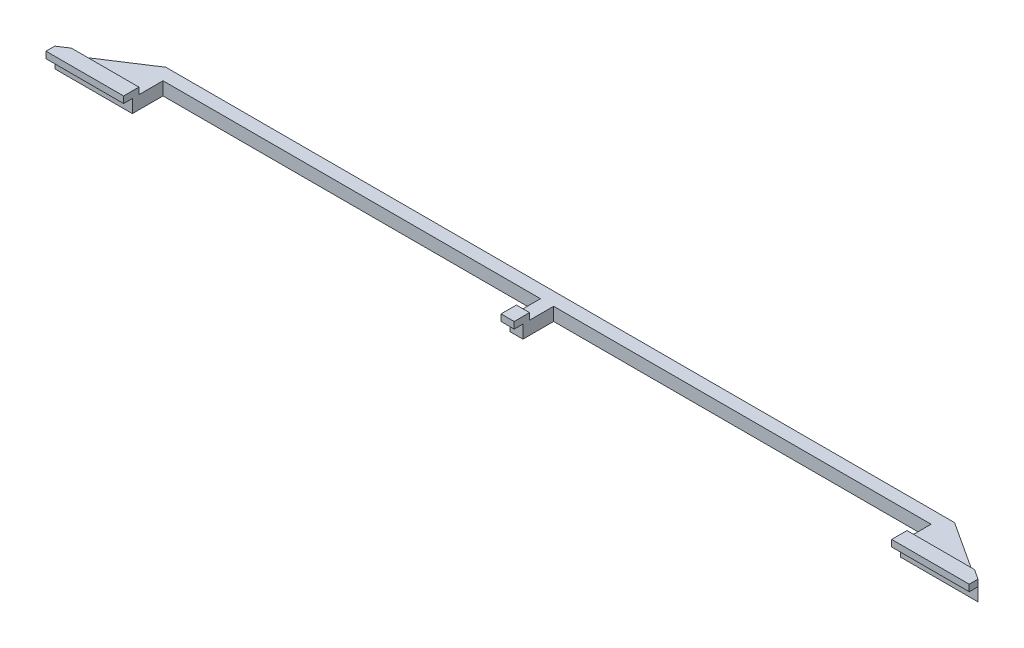
ISO-10303-21;
HEADER;
FILE_DESCRIPTION(('STEP AP214'),'2;1');
FILE_NAME('part.step','',(''),(''),'','','');
FILE_SCHEMA(('AUTOMOTIVE_DESIGN { 1 0 10303 214 1 1 1 1 }'));
ENDSEC;
DATA;
#1=APPLICATION_CONTEXT('core data for automotive mechanical design processes');
#2=APPLICATION_PROTOCOL_DEFINITION('international standard','automotive_design',2000,#1);
#3=PRODUCT_CONTEXT('',#1,'mechanical');
#4=PRODUCT('Part','Part','',(#3));
#5=PRODUCT_RELATED_PRODUCT_CATEGORY('part','',(#4));
#6=PRODUCT_DEFINITION_FORMATION('','',#4);
#7=PRODUCT_DEFINITION_CONTEXT('part definition',#1,'design');
#8=PRODUCT_DEFINITION('design','',#6,#7);
#9=PRODUCT_DEFINITION_SHAPE('','',#8);
#10=(LENGTH_UNIT() NAMED_UNIT(*) SI_UNIT(.MILLI.,.METRE.));
#11=(NAMED_UNIT(*) PLANE_ANGLE_UNIT() SI_UNIT($,.RADIAN.));
#12=(NAMED_UNIT(*) SI_UNIT($,.STERADIAN.) SOLID_ANGLE_UNIT());
#13=UNCERTAINTY_MEASURE_WITH_UNIT(LENGTH_MEASURE(1.E-05),#10,'distance_accuracy_value','');
#14=(GEOMETRIC_REPRESENTATION_CONTEXT(3) GLOBAL_UNCERTAINTY_ASSIGNED_CONTEXT((#13)) GLOBAL_UNIT_ASSIGNED_CONTEXT((#10,
#11,#12)) REPRESENTATION_CONTEXT('',''));
#15=CARTESIAN_POINT('',(0.,0.,0.));
#16=DIRECTION('',(0.,0.,1.));
#17=DIRECTION('',(1.,0.,0.));
#18=AXIS2_PLACEMENT_3D('',#15,#16,#17);
#19=CARTESIAN_POINT('',(450.,0.,85.));
#20=DIRECTION('',(0.,0.,1.));
#21=DIRECTION('',(1.,0.,0.));
#22=AXIS2_PLACEMENT_3D('',#19,#20,#21);
#23=PLANE('',#22);
#24=DIRECTION('',(1.,0.,0.));
#25=VECTOR('',#24,1.);
#26=CARTESIAN_POINT('',(450.,0.,85.));
#27=LINE('',#26,#25);
#28=CARTESIAN_POINT('',(435.,0.,85.));
#29=VERTEX_POINT('',#28);
#30=CARTESIAN_POINT('',(465.,0.,85.));
#31=VERTEX_POINT('',#30);
#32=EDGE_CURVE('E231',#29,#31,#27,.T.);
#33=ORIENTED_EDGE('',*,*,#32,.T.);
#34=DIRECTION('',(0.,1.,0.));
#35=VECTOR('',#34,1.);
#36=CARTESIAN_POINT('',(465.,0.,85.));
#37=LINE('',#36,#35);
#38=CARTESIAN_POINT('',(465.,29.8945097316654,85.));
#39=VERTEX_POINT('',#38);
#40=EDGE_CURVE('E213',#31,#39,#37,.T.);
#41=ORIENTED_EDGE('',*,*,#40,.T.);
#42=DIRECTION('',(-0.999975271591242,0.00703251064853963,0.));
#43=VECTOR('',#42,1.);
#44=CARTESIAN_POINT('',(450.,30.,85.));
#45=LINE('',#44,#43);
#46=CARTESIAN_POINT('',(450.,30.,85.));
#47=VERTEX_POINT('',#46);
#48=EDGE_CURVE('E221',#39,#47,#45,.T.);
#49=ORIENTED_EDGE('',*,*,#48,.T.);
#50=DIRECTION('',(0.999975271591242,0.00703251064853963,0.));
#51=VECTOR('',#50,1.);
#52=CARTESIAN_POINT('',(450.,30.,85.));
#53=LINE('',#52,#51);
#54=CARTESIAN_POINT('',(435.,29.8945097316654,85.));
#55=VERTEX_POINT('',#54);
#56=EDGE_CURVE('E280',#55,#47,#53,.T.);
#57=ORIENTED_EDGE('',*,*,#56,.F.);
#58=DIRECTION('',(0.,1.,0.));
#59=VECTOR('',#58,1.);
#60=CARTESIAN_POINT('',(435.,0.,85.));
#61=LINE('',#60,#59);
#62=EDGE_CURVE('E335',#29,#55,#61,.T.);
#63=ORIENTED_EDGE('',*,*,#62,.F.);
#64=EDGE_LOOP('',(#33,#41,#49,#57,#63));
#65=FACE_BOUND('',#64,.T.);
#66=ADVANCED_FACE('F36',(#65),#23,.T.);
#67=CARTESIAN_POINT('',(-603.496801426117,0.,84.9999999999999));
#68=DIRECTION('',(0.,0.,1.));
#69=DIRECTION('',(1.,0.,0.));
#70=AXIS2_PLACEMENT_3D('',#67,#68,#69);
#71=PLANE('',#70);
#72=DIRECTION('',(0.,1.,0.));
#73=VECTOR('',#72,1.);
#74=CARTESIAN_POINT('',(-426.449083655733,0.,85.));
#75=LINE('',#74,#73);
#76=CARTESIAN_POINT('',(-426.449083655733,0.,85.));
#77=VERTEX_POINT('',#76);
#78=CARTESIAN_POINT('',(-426.449083655733,30.,85.));
#79=VERTEX_POINT('',#78);
#80=EDGE_CURVE('E356',#77,#79,#75,.T.);
#81=ORIENTED_EDGE('',*,*,#80,.T.);
#82=DIRECTION('',(1.,0.,0.));
#83=VECTOR('',#82,1.);
#84=CARTESIAN_POINT('',(-426.449083655733,30.,85.));
#85=LINE('',#84,#83);
#86=CARTESIAN_POINT('',(-603.496801426117,30.,85.));
#87=VERTEX_POINT('',#86);
#88=EDGE_CURVE('E295',#87,#79,#85,.T.);
#89=ORIENTED_EDGE('',*,*,#88,.F.);
#90=DIRECTION('',(0.,1.,0.));
#91=VECTOR('',#90,1.);
#92=CARTESIAN_POINT('',(-603.496801426117,0.,84.9999999999999));
#93=LINE('',#92,#91);
#94=CARTESIAN_POINT('',(-603.496801426117,0.,84.9999999999999));
#95=VERTEX_POINT('',#94);
#96=EDGE_CURVE('E359',#95,#87,#93,.T.);
#97=ORIENTED_EDGE('',*,*,#96,.F.);
#98=DIRECTION('',(1.,0.,0.));
#99=VECTOR('',#98,1.);
#100=CARTESIAN_POINT('',(-603.496801426117,0.,84.9999999999999));
#101=LINE('',#100,#99);
#102=EDGE_CURVE('E346',#95,#77,#101,.T.);
#103=ORIENTED_EDGE('',*,*,#102,.T.);
#104=EDGE_LOOP('',(#81,#89,#97,#103));
#105=FACE_BOUND('',#104,.T.);
#106=ADVANCED_FACE('F387',(#105),#71,.T.);
#107=CARTESIAN_POINT('',(0.,30.,0.));
#108=DIRECTION('',(0.,-1.,0.));
#109=DIRECTION('',(0.,0.,-1.));
#110=AXIS2_PLACEMENT_3D('',#107,#108,#109);
#111=PLANE('',#110);
#112=DIRECTION('',(-1.,0.,0.));
#113=VECTOR('',#112,1.);
#114=CARTESIAN_POINT('',(435.,30.,69.9999999999998));
#115=LINE('',#114,#113);
#116=CARTESIAN_POINT('',(465.,30.,69.9999999999998));
#117=VERTEX_POINT('',#116);
#118=CARTESIAN_POINT('',(435.,30.,69.9999999999998));
#119=VERTEX_POINT('',#118);
#120=EDGE_CURVE('E316',#117,#119,#115,.T.);
#121=ORIENTED_EDGE('',*,*,#120,.F.);
#122=DIRECTION('',(0.,0.,1.));
#123=VECTOR('',#122,1.);
#124=CARTESIAN_POINT('',(465.,30.,85.));
#125=LINE('',#124,#123);
#126=CARTESIAN_POINT('',(465.,30.,15.));
#127=VERTEX_POINT('',#126);
#128=EDGE_CURVE('E236',#127,#117,#125,.T.);
#129=ORIENTED_EDGE('',*,*,#128,.F.);
#130=DIRECTION('',(-1.,0.,0.));
#131=VECTOR('',#130,1.);
#132=CARTESIAN_POINT('',(450.,30.,14.9999999999999));
#133=LINE('',#132,#131);
#134=CARTESIAN_POINT('',(1326.44908365573,30.,15.0000000000001));
#135=VERTEX_POINT('',#134);
#136=EDGE_CURVE('E269',#135,#127,#133,.T.);
#137=ORIENTED_EDGE('',*,*,#136,.F.);
#138=DIRECTION('',(0.,0.,-1.));
#139=VECTOR('',#138,1.);
#140=CARTESIAN_POINT('',(1326.44908365573,30.,85.));
#141=LINE('',#140,#139);
#142=CARTESIAN_POINT('',(1326.44908365573,30.,69.9999999999998));
#143=VERTEX_POINT('',#142);
#144=EDGE_CURVE('E246',#143,#135,#141,.T.);
#145=ORIENTED_EDGE('',*,*,#144,.F.);
#146=DIRECTION('',(1.,0.,0.));
#147=VECTOR('',#146,1.);
#148=CARTESIAN_POINT('',(1480.4722812122,30.,69.9999999999998));
#149=LINE('',#148,#147);
#150=CARTESIAN_POINT('',(1480.4722812122,30.,69.9999999999998));
#151=VERTEX_POINT('',#150);
#152=EDGE_CURVE('E428',#143,#151,#149,.T.);
#153=ORIENTED_EDGE('',*,*,#152,.T.);
#154=DIRECTION('',(0.837876769017591,0.,0.545859432400542));
#155=VECTOR('',#154,1.);
#156=CARTESIAN_POINT('',(1350.,30.,-14.9999999999999));
#157=LINE('',#156,#155);
#158=CARTESIAN_POINT('',(1350.,30.,-14.9999999999999));
#159=VERTEX_POINT('',#158);
#160=EDGE_CURVE('E251',#159,#151,#157,.T.);
#161=ORIENTED_EDGE('',*,*,#160,.F.);
#162=DIRECTION('',(-1.,0.,0.));
#163=VECTOR('',#162,1.);
#164=CARTESIAN_POINT('',(450.,30.,-15.0000000000001));
#165=LINE('',#164,#163);
#166=CARTESIAN_POINT('',(-450.,30.,-14.9999999999999));
#167=VERTEX_POINT('',#166);
#168=EDGE_CURVE('E44',#159,#167,#165,.T.);
#169=ORIENTED_EDGE('',*,*,#168,.T.);
#170=DIRECTION('',(-0.837876769017591,0.,0.545859432400542));
#171=VECTOR('',#170,1.);
#172=CARTESIAN_POINT('',(-450.,30.,-14.9999999999999));
#173=LINE('',#172,#171);
#174=CARTESIAN_POINT('',(-580.472281212199,30.,69.9999999999998));
#175=VERTEX_POINT('',#174);
#176=EDGE_CURVE('E350',#167,#175,#173,.T.);
#177=ORIENTED_EDGE('',*,*,#176,.T.);
#178=DIRECTION('',(-1.,0.,0.));
#179=VECTOR('',#178,1.);
#180=CARTESIAN_POINT('',(-580.472281212199,30.,69.9999999999998));
#181=LINE('',#180,#179);
#182=CARTESIAN_POINT('',(-426.449083655733,30.,69.9999999999998));
#183=VERTEX_POINT('',#182);
#184=EDGE_CURVE('E58',#183,#175,#181,.T.);
#185=ORIENTED_EDGE('',*,*,#184,.F.);
#186=DIRECTION('',(0.,0.,-1.));
#187=VECTOR('',#186,1.);
#188=CARTESIAN_POINT('',(-426.449083655733,30.,85.));
#189=LINE('',#188,#187);
#190=CARTESIAN_POINT('',(-426.449083655733,30.,15.0000000000001));
#191=VERTEX_POINT('',#190);
#192=EDGE_CURVE('E345',#183,#191,#189,.T.);
#193=ORIENTED_EDGE('',*,*,#192,.T.);
#194=DIRECTION('',(1.,0.,0.));
#195=VECTOR('',#194,1.);
#196=CARTESIAN_POINT('',(450.,30.,14.9999999999999));
#197=LINE('',#196,#195);
#198=CARTESIAN_POINT('',(435.,30.,15.));
#199=VERTEX_POINT('',#198);
#200=EDGE_CURVE('E367',#191,#199,#197,.T.);
#201=ORIENTED_EDGE('',*,*,#200,.T.);
#202=DIRECTION('',(0.,0.,1.));
#203=VECTOR('',#202,1.);
#204=CARTESIAN_POINT('',(435.,30.,85.));
#205=LINE('',#204,#203);
#206=EDGE_CURVE('E51',#199,#119,#205,.T.);
#207=ORIENTED_EDGE('',*,*,#206,.T.);
#208=EDGE_LOOP('',(#121,#129,#137,#145,#153,#161,#169,#177,#185,#193,#201,#207));
#209=FACE_BOUND('',#208,.T.);
#210=ADVANCED_FACE('F408',(#209),#111,.F.);
#211=CARTESIAN_POINT('',(450.,30.,14.9999999999999));
#212=DIRECTION('',(0.,0.,-1.));
#213=DIRECTION('',(-1.,0.,0.));
#214=AXIS2_PLACEMENT_3D('',#211,#212,#213);
#215=PLANE('',#214);
#216=DIRECTION('',(1.,0.,0.));
#217=VECTOR('',#216,1.);
#218=CARTESIAN_POINT('',(450.,0.,14.9999999999999));
#219=LINE('',#218,#217);
#220=CARTESIAN_POINT('',(-426.449083655733,0.,15.0000000000001));
#221=VERTEX_POINT('',#220);
#222=CARTESIAN_POINT('',(435.,0.,15.));
#223=VERTEX_POINT('',#222);
#224=EDGE_CURVE('E366',#221,#223,#219,.T.);
#225=ORIENTED_EDGE('',*,*,#224,.T.);
#226=DIRECTION('',(0.,1.,0.));
#227=VECTOR('',#226,1.);
#228=CARTESIAN_POINT('',(435.,30.,14.9999999999999));
#229=LINE('',#228,#227);
#230=EDGE_CURVE('E339',#223,#199,#229,.T.);
#231=ORIENTED_EDGE('',*,*,#230,.T.);
#232=ORIENTED_EDGE('',*,*,#200,.F.);
#233=DIRECTION('',(0.,-1.,0.));
#234=VECTOR('',#233,1.);
#235=CARTESIAN_POINT('',(-426.449083655733,30.,15.0000000000001));
#236=LINE('',#235,#234);
#237=EDGE_CURVE('E362',#191,#221,#236,.T.);
#238=ORIENTED_EDGE('',*,*,#237,.T.);
#239=EDGE_LOOP('',(#225,#231,#232,#238));
#240=FACE_BOUND('',#239,.T.);
#241=ADVANCED_FACE('F38',(#240),#215,.F.);
#242=CARTESIAN_POINT('',(450.,30.,-15.0000000000001));
#243=DIRECTION('',(0.,0.,1.));
#244=DIRECTION('',(1.,0.,0.));
#245=AXIS2_PLACEMENT_3D('',#242,#243,#244);
#246=PLANE('',#245);
#247=DIRECTION('',(0.,-1.,0.));
#248=VECTOR('',#247,1.);
#249=CARTESIAN_POINT('',(-450.,30.,-14.9999999999999));
#250=LINE('',#249,#248);
#251=CARTESIAN_POINT('',(-450.,0.,-14.9999999999999));
#252=VERTEX_POINT('',#251);
#253=EDGE_CURVE('E11',#167,#252,#250,.T.);
#254=ORIENTED_EDGE('',*,*,#253,.F.);
#255=ORIENTED_EDGE('',*,*,#168,.F.);
#256=DIRECTION('',(0.,-1.,0.));
#257=VECTOR('',#256,1.);
#258=CARTESIAN_POINT('',(1350.,30.,-14.9999999999999));
#259=LINE('',#258,#257);
#260=CARTESIAN_POINT('',(1350.,0.,-14.9999999999999));
#261=VERTEX_POINT('',#260);
#262=EDGE_CURVE('E272',#159,#261,#259,.T.);
#263=ORIENTED_EDGE('',*,*,#262,.T.);
#264=DIRECTION('',(-1.,0.,0.));
#265=VECTOR('',#264,1.);
#266=CARTESIAN_POINT('',(450.,0.,-15.0000000000001));
#267=LINE('',#266,#265);
#268=EDGE_CURVE('E369',#261,#252,#267,.T.);
#269=ORIENTED_EDGE('',*,*,#268,.T.);
#270=EDGE_LOOP('',(#254,#255,#263,#269));
#271=FACE_BOUND('',#270,.T.);
#272=ADVANCED_FACE('F374',(#271),#246,.F.);
#273=CARTESIAN_POINT('',(0.,0.,0.));
#274=DIRECTION('',(0.,-1.,0.));
#275=DIRECTION('',(0.,0.,-1.));
#276=AXIS2_PLACEMENT_3D('',#273,#274,#275);
#277=PLANE('',#276);
#278=DIRECTION('',(-0.837876769017591,0.,0.545859432400542));
#279=VECTOR('',#278,1.);
#280=CARTESIAN_POINT('',(-450.,0.,-14.9999999999999));
#281=LINE('',#280,#279);
#282=EDGE_CURVE('E353',#252,#95,#281,.T.);
#283=ORIENTED_EDGE('',*,*,#282,.F.);
#284=ORIENTED_EDGE('',*,*,#268,.F.);
#285=DIRECTION('',(0.837876769017591,0.,0.545859432400542));
#286=VECTOR('',#285,1.);
#287=CARTESIAN_POINT('',(1350.,0.,-14.9999999999999));
#288=LINE('',#287,#286);
#289=CARTESIAN_POINT('',(1503.49680142612,0.,84.9999999999999));
#290=VERTEX_POINT('',#289);
#291=EDGE_CURVE('E253',#261,#290,#288,.T.);
#292=ORIENTED_EDGE('',*,*,#291,.T.);
#293=DIRECTION('',(-1.,0.,0.));
#294=VECTOR('',#293,1.);
#295=CARTESIAN_POINT('',(1503.49680142612,0.,84.9999999999999));
#296=LINE('',#295,#294);
#297=CARTESIAN_POINT('',(1326.44908365573,0.,85.));
#298=VERTEX_POINT('',#297);
#299=EDGE_CURVE('E247',#290,#298,#296,.T.);
#300=ORIENTED_EDGE('',*,*,#299,.T.);
#301=DIRECTION('',(0.,0.,-1.));
#302=VECTOR('',#301,1.);
#303=CARTESIAN_POINT('',(1326.44908365573,0.,85.));
#304=LINE('',#303,#302);
#305=CARTESIAN_POINT('',(1326.44908365573,0.,15.0000000000001));
#306=VERTEX_POINT('',#305);
#307=EDGE_CURVE('E250',#298,#306,#304,.T.);
#308=ORIENTED_EDGE('',*,*,#307,.T.);
#309=DIRECTION('',(-1.,0.,0.));
#310=VECTOR('',#309,1.);
#311=CARTESIAN_POINT('',(450.,0.,14.9999999999999));
#312=LINE('',#311,#310);
#313=CARTESIAN_POINT('',(465.,0.,15.));
#314=VERTEX_POINT('',#313);
#315=EDGE_CURVE('E268',#306,#314,#312,.T.);
#316=ORIENTED_EDGE('',*,*,#315,.T.);
#317=DIRECTION('',(0.,0.,1.));
#318=VECTOR('',#317,1.);
#319=CARTESIAN_POINT('',(465.,0.,85.));
#320=LINE('',#319,#318);
#321=EDGE_CURVE('E233',#314,#31,#320,.T.);
#322=ORIENTED_EDGE('',*,*,#321,.T.);
#323=ORIENTED_EDGE('',*,*,#32,.F.);
#324=DIRECTION('',(0.,0.,1.));
#325=VECTOR('',#324,1.);
#326=CARTESIAN_POINT('',(435.,0.,85.));
#327=LINE('',#326,#325);
#328=EDGE_CURVE('E340',#223,#29,#327,.T.);
#329=ORIENTED_EDGE('',*,*,#328,.F.);
#330=ORIENTED_EDGE('',*,*,#224,.F.);
#331=DIRECTION('',(0.,0.,-1.));
#332=VECTOR('',#331,1.);
#333=CARTESIAN_POINT('',(-426.449083655733,0.,85.));
#334=LINE('',#333,#332);
#335=EDGE_CURVE('E349',#77,#221,#334,.T.);
#336=ORIENTED_EDGE('',*,*,#335,.F.);
#337=ORIENTED_EDGE('',*,*,#102,.F.);
#338=EDGE_LOOP('',(#283,#284,#292,#300,#308,#316,#322,#323,#329,#330,#336,#337));
#339=FACE_BOUND('',#338,.T.);
#340=ADVANCED_FACE('F383',(#339),#277,.T.);
#341=CARTESIAN_POINT('',(-426.449083655733,0.,85.));
#342=DIRECTION('',(1.,0.,0.));
#343=DIRECTION('',(0.,0.,-1.));
#344=AXIS2_PLACEMENT_3D('',#341,#342,#343);
#345=PLANE('',#344);
#346=ORIENTED_EDGE('',*,*,#237,.F.);
#347=ORIENTED_EDGE('',*,*,#192,.F.);
#348=DIRECTION('',(0.,-1.,0.));
#349=VECTOR('',#348,1.);
#350=CARTESIAN_POINT('',(-426.449083655733,45.,69.9999999999998));
#351=LINE('',#350,#349);
#352=CARTESIAN_POINT('',(-426.449083655733,45.,69.9999999999998));
#353=VERTEX_POINT('',#352);
#354=EDGE_CURVE('E332',#353,#183,#351,.T.);
#355=ORIENTED_EDGE('',*,*,#354,.F.);
#356=DIRECTION('',(0.,0.,-1.));
#357=VECTOR('',#356,1.);
#358=CARTESIAN_POINT('',(-426.449083655733,45.,69.9999999999998));
#359=LINE('',#358,#357);
#360=CARTESIAN_POINT('',(-426.449083655733,45.,105.));
#361=VERTEX_POINT('',#360);
#362=EDGE_CURVE('E321',#361,#353,#359,.T.);
#363=ORIENTED_EDGE('',*,*,#362,.F.);
#364=DIRECTION('',(0.,1.,0.));
#365=VECTOR('',#364,1.);
#366=CARTESIAN_POINT('',(-426.449083655733,45.,105.));
#367=LINE('',#366,#365);
#368=CARTESIAN_POINT('',(-426.449083655733,30.,105.));
#369=VERTEX_POINT('',#368);
#370=EDGE_CURVE('E297',#369,#361,#367,.T.);
#371=ORIENTED_EDGE('',*,*,#370,.F.);
#372=DIRECTION('',(0.,0.,-1.));
#373=VECTOR('',#372,1.);
#374=CARTESIAN_POINT('',(-426.449083655733,30.,105.));
#375=LINE('',#374,#373);
#376=EDGE_CURVE('E307',#369,#79,#375,.T.);
#377=ORIENTED_EDGE('',*,*,#376,.T.);
#378=ORIENTED_EDGE('',*,*,#80,.F.);
#379=ORIENTED_EDGE('',*,*,#335,.T.);
#380=EDGE_LOOP('',(#346,#347,#355,#363,#371,#377,#378,#379));
#381=FACE_BOUND('',#380,.T.);
#382=ADVANCED_FACE('F405',(#381),#345,.T.);
#383=CARTESIAN_POINT('',(-450.,0.,-14.9999999999999));
#384=DIRECTION('',(-0.545859432400542,0.,-0.837876769017591));
#385=DIRECTION('',(-0.837876769017591,0.,0.545859432400542));
#386=AXIS2_PLACEMENT_3D('',#383,#384,#385);
#387=PLANE('',#386);
#388=ORIENTED_EDGE('',*,*,#176,.F.);
#389=ORIENTED_EDGE('',*,*,#253,.T.);
#390=ORIENTED_EDGE('',*,*,#282,.T.);
#391=ORIENTED_EDGE('',*,*,#96,.T.);
#392=DIRECTION('',(0.,-1.,0.));
#393=VECTOR('',#392,1.);
#394=CARTESIAN_POINT('',(-603.496801426117,30.,85.));
#395=LINE('',#394,#393);
#396=CARTESIAN_POINT('',(-603.496801426117,45.,85.));
#397=VERTEX_POINT('',#396);
#398=EDGE_CURVE('E282',#397,#87,#395,.T.);
#399=ORIENTED_EDGE('',*,*,#398,.F.);
#400=DIRECTION('',(-0.837876769017592,0.,0.545859432400541));
#401=VECTOR('',#400,1.);
#402=CARTESIAN_POINT('',(-603.496801426117,45.,84.9999999999999));
#403=LINE('',#402,#401);
#404=CARTESIAN_POINT('',(-580.472281212199,45.,69.9999999999998));
#405=VERTEX_POINT('',#404);
#406=EDGE_CURVE('E325',#405,#397,#403,.T.);
#407=ORIENTED_EDGE('',*,*,#406,.F.);
#408=DIRECTION('',(0.,-1.,0.));
#409=VECTOR('',#408,1.);
#410=CARTESIAN_POINT('',(-580.472281212199,45.,69.9999999999998));
#411=LINE('',#410,#409);
#412=EDGE_CURVE('E328',#405,#175,#411,.T.);
#413=ORIENTED_EDGE('',*,*,#412,.T.);
#414=EDGE_LOOP('',(#388,#389,#390,#391,#399,#407,#413));
#415=FACE_BOUND('',#414,.T.);
#416=ADVANCED_FACE('F381',(#415),#387,.T.);
#417=CARTESIAN_POINT('',(435.,0.,85.));
#418=DIRECTION('',(-1.,0.,0.));
#419=DIRECTION('',(0.,0.,1.));
#420=AXIS2_PLACEMENT_3D('',#417,#418,#419);
#421=PLANE('',#420);
#422=ORIENTED_EDGE('',*,*,#230,.F.);
#423=ORIENTED_EDGE('',*,*,#328,.T.);
#424=ORIENTED_EDGE('',*,*,#62,.T.);
#425=DIRECTION('',(0.,0.,-1.));
#426=VECTOR('',#425,1.);
#427=CARTESIAN_POINT('',(435.,29.8945097316654,105.));
#428=LINE('',#427,#426);
#429=CARTESIAN_POINT('',(435.,29.8945097316654,105.));
#430=VERTEX_POINT('',#429);
#431=EDGE_CURVE('E277',#430,#55,#428,.T.);
#432=ORIENTED_EDGE('',*,*,#431,.F.);
#433=DIRECTION('',(0.,-1.,0.));
#434=VECTOR('',#433,1.);
#435=CARTESIAN_POINT('',(435.,29.8945097316654,105.));
#436=LINE('',#435,#434);
#437=CARTESIAN_POINT('',(435.,45.,105.));
#438=VERTEX_POINT('',#437);
#439=EDGE_CURVE('E283',#438,#430,#436,.T.);
#440=ORIENTED_EDGE('',*,*,#439,.F.);
#441=DIRECTION('',(0.,0.,1.));
#442=VECTOR('',#441,1.);
#443=CARTESIAN_POINT('',(435.,45.,84.9999999999998));
#444=LINE('',#443,#442);
#445=CARTESIAN_POINT('',(435.,45.,69.9999999999998));
#446=VERTEX_POINT('',#445);
#447=EDGE_CURVE('E315',#446,#438,#444,.T.);
#448=ORIENTED_EDGE('',*,*,#447,.F.);
#449=DIRECTION('',(0.,-1.,0.));
#450=VECTOR('',#449,1.);
#451=CARTESIAN_POINT('',(435.,45.,69.9999999999998));
#452=LINE('',#451,#450);
#453=EDGE_CURVE('E312',#446,#119,#452,.T.);
#454=ORIENTED_EDGE('',*,*,#453,.T.);
#455=ORIENTED_EDGE('',*,*,#206,.F.);
#456=EDGE_LOOP('',(#422,#423,#424,#432,#440,#448,#454,#455));
#457=FACE_BOUND('',#456,.T.);
#458=ADVANCED_FACE('F412',(#457),#421,.T.);
#459=CARTESIAN_POINT('',(-580.472281212199,45.,69.9999999999998));
#460=DIRECTION('',(0.,0.,1.));
#461=DIRECTION('',(1.,0.,0.));
#462=AXIS2_PLACEMENT_3D('',#459,#460,#461);
#463=PLANE('',#462);
#464=ORIENTED_EDGE('',*,*,#184,.T.);
#465=ORIENTED_EDGE('',*,*,#412,.F.);
#466=DIRECTION('',(-1.,0.,0.));
#467=VECTOR('',#466,1.);
#468=CARTESIAN_POINT('',(-580.472281212199,45.,69.9999999999998));
#469=LINE('',#468,#467);
#470=EDGE_CURVE('E323',#353,#405,#469,.T.);
#471=ORIENTED_EDGE('',*,*,#470,.F.);
#472=ORIENTED_EDGE('',*,*,#354,.T.);
#473=EDGE_LOOP('',(#464,#465,#471,#472));
#474=FACE_BOUND('',#473,.T.);
#475=ADVANCED_FACE('F402',(#474),#463,.F.);
#476=CARTESIAN_POINT('',(0.,45.,0.));
#477=DIRECTION('',(0.,1.,0.));
#478=DIRECTION('',(0.,0.,1.));
#479=AXIS2_PLACEMENT_3D('',#476,#477,#478);
#480=PLANE('',#479);
#481=ORIENTED_EDGE('',*,*,#406,.T.);
#482=DIRECTION('',(0.,0.,-1.));
#483=VECTOR('',#482,1.);
#484=CARTESIAN_POINT('',(-603.496801426117,45.,105.));
#485=LINE('',#484,#483);
#486=CARTESIAN_POINT('',(-603.496801426117,45.,105.));
#487=VERTEX_POINT('',#486);
#488=EDGE_CURVE('E302',#487,#397,#485,.T.);
#489=ORIENTED_EDGE('',*,*,#488,.F.);
#490=DIRECTION('',(-1.,0.,0.));
#491=VECTOR('',#490,1.);
#492=CARTESIAN_POINT('',(-603.496801426117,45.,105.));
#493=LINE('',#492,#491);
#494=EDGE_CURVE('E300',#361,#487,#493,.T.);
#495=ORIENTED_EDGE('',*,*,#494,.F.);
#496=ORIENTED_EDGE('',*,*,#362,.T.);
#497=ORIENTED_EDGE('',*,*,#470,.T.);
#498=EDGE_LOOP('',(#481,#489,#495,#496,#497));
#499=FACE_BOUND('',#498,.T.);
#500=ADVANCED_FACE('F395',(#499),#480,.T.);
#501=CARTESIAN_POINT('',(435.,45.,69.9999999999998));
#502=DIRECTION('',(0.,0.,1.));
#503=DIRECTION('',(1.,0.,0.));
#504=AXIS2_PLACEMENT_3D('',#501,#502,#503);
#505=PLANE('',#504);
#506=ORIENTED_EDGE('',*,*,#120,.T.);
#507=ORIENTED_EDGE('',*,*,#453,.F.);
#508=DIRECTION('',(-1.,0.,0.));
#509=VECTOR('',#508,1.);
#510=CARTESIAN_POINT('',(435.,45.,69.9999999999998));
#511=LINE('',#510,#509);
#512=CARTESIAN_POINT('',(465.,45.,69.9999999999998));
#513=VERTEX_POINT('',#512);
#514=EDGE_CURVE('E318',#513,#446,#511,.T.);
#515=ORIENTED_EDGE('',*,*,#514,.F.);
#516=DIRECTION('',(0.,-1.,0.));
#517=VECTOR('',#516,1.);
#518=CARTESIAN_POINT('',(465.,45.,69.9999999999998));
#519=LINE('',#518,#517);
#520=EDGE_CURVE('E422',#513,#117,#519,.T.);
#521=ORIENTED_EDGE('',*,*,#520,.T.);
#522=EDGE_LOOP('',(#506,#507,#515,#521));
#523=FACE_BOUND('',#522,.T.);
#524=ADVANCED_FACE('F503',(#523),#505,.F.);
#525=CARTESIAN_POINT('',(0.,45.,0.));
#526=DIRECTION('',(0.,-1.,0.));
#527=DIRECTION('',(0.,0.,-1.));
#528=AXIS2_PLACEMENT_3D('',#525,#526,#527);
#529=PLANE('',#528);
#530=DIRECTION('',(-1.,0.,0.));
#531=VECTOR('',#530,1.);
#532=CARTESIAN_POINT('',(435.,45.,105.));
#533=LINE('',#532,#531);
#534=CARTESIAN_POINT('',(465.,45.,105.));
#535=VERTEX_POINT('',#534);
#536=EDGE_CURVE('E279',#535,#438,#533,.T.);
#537=ORIENTED_EDGE('',*,*,#536,.F.);
#538=DIRECTION('',(0.,0.,1.));
#539=VECTOR('',#538,1.);
#540=CARTESIAN_POINT('',(465.,45.,84.9999999999998));
#541=LINE('',#540,#539);
#542=EDGE_CURVE('E424',#513,#535,#541,.T.);
#543=ORIENTED_EDGE('',*,*,#542,.F.);
#544=ORIENTED_EDGE('',*,*,#514,.T.);
#545=ORIENTED_EDGE('',*,*,#447,.T.);
#546=EDGE_LOOP('',(#537,#543,#544,#545));
#547=FACE_BOUND('',#546,.T.);
#548=ADVANCED_FACE('F502',(#547),#529,.F.);
#549=CARTESIAN_POINT('',(-603.496801426117,30.,105.));
#550=DIRECTION('',(1.,0.,0.));
#551=DIRECTION('',(0.,0.,-1.));
#552=AXIS2_PLACEMENT_3D('',#549,#550,#551);
#553=PLANE('',#552);
#554=ORIENTED_EDGE('',*,*,#398,.T.);
#555=DIRECTION('',(0.,0.,-1.));
#556=VECTOR('',#555,1.);
#557=CARTESIAN_POINT('',(-603.496801426117,30.,105.));
#558=LINE('',#557,#556);
#559=CARTESIAN_POINT('',(-603.496801426117,30.,105.));
#560=VERTEX_POINT('',#559);
#561=EDGE_CURVE('E310',#560,#87,#558,.T.);
#562=ORIENTED_EDGE('',*,*,#561,.F.);
#563=DIRECTION('',(0.,-1.,0.));
#564=VECTOR('',#563,1.);
#565=CARTESIAN_POINT('',(-603.496801426117,30.,105.));
#566=LINE('',#565,#564);
#567=EDGE_CURVE('E291',#487,#560,#566,.T.);
#568=ORIENTED_EDGE('',*,*,#567,.F.);
#569=ORIENTED_EDGE('',*,*,#488,.T.);
#570=EDGE_LOOP('',(#554,#562,#568,#569));
#571=FACE_BOUND('',#570,.T.);
#572=ADVANCED_FACE('F510',(#571),#553,.F.);
#573=CARTESIAN_POINT('',(-426.449083655733,30.,105.));
#574=DIRECTION('',(0.,1.,0.));
#575=DIRECTION('',(-1.,0.,0.));
#576=AXIS2_PLACEMENT_3D('',#573,#574,#575);
#577=PLANE('',#576);
#578=ORIENTED_EDGE('',*,*,#88,.T.);
#579=ORIENTED_EDGE('',*,*,#376,.F.);
#580=DIRECTION('',(1.,0.,0.));
#581=VECTOR('',#580,1.);
#582=CARTESIAN_POINT('',(-426.449083655733,30.,105.));
#583=LINE('',#582,#581);
#584=EDGE_CURVE('E294',#560,#369,#583,.T.);
#585=ORIENTED_EDGE('',*,*,#584,.F.);
#586=ORIENTED_EDGE('',*,*,#561,.T.);
#587=EDGE_LOOP('',(#578,#579,#585,#586));
#588=FACE_BOUND('',#587,.T.);
#589=ADVANCED_FACE('F645',(#588),#577,.F.);
#590=CARTESIAN_POINT('',(0.,0.,105.));
#591=DIRECTION('',(0.,0.,-1.));
#592=DIRECTION('',(-1.,0.,0.));
#593=AXIS2_PLACEMENT_3D('',#590,#591,#592);
#594=PLANE('',#593);
#595=ORIENTED_EDGE('',*,*,#567,.T.);
#596=ORIENTED_EDGE('',*,*,#584,.T.);
#597=ORIENTED_EDGE('',*,*,#370,.T.);
#598=ORIENTED_EDGE('',*,*,#494,.T.);
#599=EDGE_LOOP('',(#595,#596,#597,#598));
#600=FACE_BOUND('',#599,.T.);
#601=ADVANCED_FACE('F654',(#600),#594,.F.);
#602=CARTESIAN_POINT('',(450.,30.,105.));
#603=DIRECTION('',(-0.00703251064853963,0.999975271591242,0.));
#604=DIRECTION('',(-0.999975271591242,-0.00703251064853963,0.));
#605=AXIS2_PLACEMENT_3D('',#602,#603,#604);
#606=PLANE('',#605);
#607=ORIENTED_EDGE('',*,*,#56,.T.);
#608=DIRECTION('',(0.,0.,-1.));
#609=VECTOR('',#608,1.);
#610=CARTESIAN_POINT('',(450.,30.,105.));
#611=LINE('',#610,#609);
#612=CARTESIAN_POINT('',(450.,30.,105.));
#613=VERTEX_POINT('',#612);
#614=EDGE_CURVE('E218',#613,#47,#611,.T.);
#615=ORIENTED_EDGE('',*,*,#614,.F.);
#616=DIRECTION('',(0.999975271591242,0.00703251064853963,0.));
#617=VECTOR('',#616,1.);
#618=CARTESIAN_POINT('',(450.,30.,105.));
#619=LINE('',#618,#617);
#620=EDGE_CURVE('E286',#430,#613,#619,.T.);
#621=ORIENTED_EDGE('',*,*,#620,.F.);
#622=ORIENTED_EDGE('',*,*,#431,.T.);
#623=EDGE_LOOP('',(#607,#615,#621,#622));
#624=FACE_BOUND('',#623,.T.);
#625=ADVANCED_FACE('F498',(#624),#606,.F.);
#626=CARTESIAN_POINT('',(0.,0.,105.));
#627=DIRECTION('',(0.,0.,-1.));
#628=DIRECTION('',(-1.,0.,0.));
#629=AXIS2_PLACEMENT_3D('',#626,#627,#628);
#630=PLANE('',#629);
#631=ORIENTED_EDGE('',*,*,#439,.T.);
#632=ORIENTED_EDGE('',*,*,#620,.T.);
#633=DIRECTION('',(-0.999975271591242,0.00703251064853963,0.));
#634=VECTOR('',#633,1.);
#635=CARTESIAN_POINT('',(450.,30.,105.));
#636=LINE('',#635,#634);
#637=CARTESIAN_POINT('',(465.,29.8945097316654,105.));
#638=VERTEX_POINT('',#637);
#639=EDGE_CURVE('E491',#638,#613,#636,.T.);
#640=ORIENTED_EDGE('',*,*,#639,.F.);
#641=DIRECTION('',(0.,-1.,0.));
#642=VECTOR('',#641,1.);
#643=CARTESIAN_POINT('',(465.,29.8945097316654,105.));
#644=LINE('',#643,#642);
#645=EDGE_CURVE('E216',#535,#638,#644,.T.);
#646=ORIENTED_EDGE('',*,*,#645,.F.);
#647=ORIENTED_EDGE('',*,*,#536,.T.);
#648=EDGE_LOOP('',(#631,#632,#640,#646,#647));
#649=FACE_BOUND('',#648,.T.);
#650=ADVANCED_FACE('F494',(#649),#630,.F.);
#651=CARTESIAN_POINT('',(1503.49680142612,0.,84.9999999999999));
#652=DIRECTION('',(0.,0.,1.));
#653=DIRECTION('',(-1.,0.,0.));
#654=AXIS2_PLACEMENT_3D('',#651,#652,#653);
#655=PLANE('',#654);
#656=DIRECTION('',(0.,1.,0.));
#657=VECTOR('',#656,1.);
#658=CARTESIAN_POINT('',(1326.44908365573,0.,85.));
#659=LINE('',#658,#657);
#660=CARTESIAN_POINT('',(1326.44908365573,30.,85.));
#661=VERTEX_POINT('',#660);
#662=EDGE_CURVE('E255',#298,#661,#659,.T.);
#663=ORIENTED_EDGE('',*,*,#662,.F.);
#664=ORIENTED_EDGE('',*,*,#299,.F.);
#665=DIRECTION('',(0.,1.,0.));
#666=VECTOR('',#665,1.);
#667=CARTESIAN_POINT('',(1503.49680142612,0.,84.9999999999999));
#668=LINE('',#667,#666);
#669=CARTESIAN_POINT('',(1503.49680142612,30.,85.));
#670=VERTEX_POINT('',#669);
#671=EDGE_CURVE('E260',#290,#670,#668,.T.);
#672=ORIENTED_EDGE('',*,*,#671,.T.);
#673=DIRECTION('',(-1.,0.,0.));
#674=VECTOR('',#673,1.);
#675=CARTESIAN_POINT('',(1326.44908365573,30.,85.));
#676=LINE('',#675,#674);
#677=EDGE_CURVE('E471',#670,#661,#676,.T.);
#678=ORIENTED_EDGE('',*,*,#677,.T.);
#679=EDGE_LOOP('',(#663,#664,#672,#678));
#680=FACE_BOUND('',#679,.T.);
#681=ADVANCED_FACE('F482',(#680),#655,.T.);
#682=CARTESIAN_POINT('',(450.,30.,14.9999999999999));
#683=DIRECTION('',(0.,0.,-1.));
#684=DIRECTION('',(1.,0.,0.));
#685=AXIS2_PLACEMENT_3D('',#682,#683,#684);
#686=PLANE('',#685);
#687=ORIENTED_EDGE('',*,*,#315,.F.);
#688=DIRECTION('',(0.,-1.,0.));
#689=VECTOR('',#688,1.);
#690=CARTESIAN_POINT('',(1326.44908365573,30.,15.0000000000001));
#691=LINE('',#690,#689);
#692=EDGE_CURVE('E263',#135,#306,#691,.T.);
#693=ORIENTED_EDGE('',*,*,#692,.F.);
#694=ORIENTED_EDGE('',*,*,#136,.T.);
#695=DIRECTION('',(0.,1.,0.));
#696=VECTOR('',#695,1.);
#697=CARTESIAN_POINT('',(465.,30.,14.9999999999999));
#698=LINE('',#697,#696);
#699=EDGE_CURVE('E243',#314,#127,#698,.T.);
#700=ORIENTED_EDGE('',*,*,#699,.F.);
#701=EDGE_LOOP('',(#687,#693,#694,#700));
#702=FACE_BOUND('',#701,.T.);
#703=ADVANCED_FACE('F416',(#702),#686,.F.);
#704=CARTESIAN_POINT('',(1326.44908365573,0.,85.));
#705=DIRECTION('',(-1.,0.,0.));
#706=DIRECTION('',(0.,0.,-1.));
#707=AXIS2_PLACEMENT_3D('',#704,#705,#706);
#708=PLANE('',#707);
#709=ORIENTED_EDGE('',*,*,#692,.T.);
#710=ORIENTED_EDGE('',*,*,#307,.F.);
#711=ORIENTED_EDGE('',*,*,#662,.T.);
#712=DIRECTION('',(0.,0.,-1.));
#713=VECTOR('',#712,1.);
#714=CARTESIAN_POINT('',(1326.44908365573,30.,105.));
#715=LINE('',#714,#713);
#716=CARTESIAN_POINT('',(1326.44908365573,30.,105.));
#717=VERTEX_POINT('',#716);
#718=EDGE_CURVE('E430',#717,#661,#715,.T.);
#719=ORIENTED_EDGE('',*,*,#718,.F.);
#720=DIRECTION('',(0.,1.,0.));
#721=VECTOR('',#720,1.);
#722=CARTESIAN_POINT('',(1326.44908365573,45.,105.));
#723=LINE('',#722,#721);
#724=CARTESIAN_POINT('',(1326.44908365573,45.,105.));
#725=VERTEX_POINT('',#724);
#726=EDGE_CURVE('E458',#717,#725,#723,.T.);
#727=ORIENTED_EDGE('',*,*,#726,.T.);
#728=DIRECTION('',(0.,0.,-1.));
#729=VECTOR('',#728,1.);
#730=CARTESIAN_POINT('',(1326.44908365573,45.,69.9999999999998));
#731=LINE('',#730,#729);
#732=CARTESIAN_POINT('',(1326.44908365573,45.,69.9999999999998));
#733=VERTEX_POINT('',#732);
#734=EDGE_CURVE('E434',#725,#733,#731,.T.);
#735=ORIENTED_EDGE('',*,*,#734,.T.);
#736=DIRECTION('',(0.,-1.,0.));
#737=VECTOR('',#736,1.);
#738=CARTESIAN_POINT('',(1326.44908365573,45.,69.9999999999998));
#739=LINE('',#738,#737);
#740=EDGE_CURVE('E234',#733,#143,#739,.T.);
#741=ORIENTED_EDGE('',*,*,#740,.T.);
#742=ORIENTED_EDGE('',*,*,#144,.T.);
#743=EDGE_LOOP('',(#709,#710,#711,#719,#727,#735,#741,#742));
#744=FACE_BOUND('',#743,.T.);
#745=ADVANCED_FACE('F453',(#744),#708,.T.);
#746=CARTESIAN_POINT('',(1350.,0.,-14.9999999999999));
#747=DIRECTION('',(0.545859432400542,0.,-0.837876769017591));
#748=DIRECTION('',(0.837876769017591,0.,0.545859432400542));
#749=AXIS2_PLACEMENT_3D('',#746,#747,#748);
#750=PLANE('',#749);
#751=ORIENTED_EDGE('',*,*,#160,.T.);
#752=DIRECTION('',(0.,-1.,0.));
#753=VECTOR('',#752,1.);
#754=CARTESIAN_POINT('',(1480.4722812122,45.,69.9999999999998));
#755=LINE('',#754,#753);
#756=CARTESIAN_POINT('',(1480.4722812122,45.,69.9999999999998));
#757=VERTEX_POINT('',#756);
#758=EDGE_CURVE('E238',#757,#151,#755,.T.);
#759=ORIENTED_EDGE('',*,*,#758,.F.);
#760=DIRECTION('',(0.837876769017592,0.,0.545859432400541));
#761=VECTOR('',#760,1.);
#762=CARTESIAN_POINT('',(1503.49680142612,45.,84.9999999999999));
#763=LINE('',#762,#761);
#764=CARTESIAN_POINT('',(1503.49680142612,45.,85.));
#765=VERTEX_POINT('',#764);
#766=EDGE_CURVE('E439',#757,#765,#763,.T.);
#767=ORIENTED_EDGE('',*,*,#766,.T.);
#768=DIRECTION('',(0.,-1.,0.));
#769=VECTOR('',#768,1.);
#770=CARTESIAN_POINT('',(1503.49680142612,30.,85.));
#771=LINE('',#770,#769);
#772=EDGE_CURVE('E227',#765,#670,#771,.T.);
#773=ORIENTED_EDGE('',*,*,#772,.T.);
#774=ORIENTED_EDGE('',*,*,#671,.F.);
#775=ORIENTED_EDGE('',*,*,#291,.F.);
#776=ORIENTED_EDGE('',*,*,#262,.F.);
#777=EDGE_LOOP('',(#751,#759,#767,#773,#774,#775,#776));
#778=FACE_BOUND('',#777,.T.);
#779=ADVANCED_FACE('F451',(#778),#750,.T.);
#780=CARTESIAN_POINT('',(465.,0.,85.));
#781=DIRECTION('',(1.,0.,0.));
#782=DIRECTION('',(0.,0.,1.));
#783=AXIS2_PLACEMENT_3D('',#780,#781,#782);
#784=PLANE('',#783);
#785=ORIENTED_EDGE('',*,*,#699,.T.);
#786=ORIENTED_EDGE('',*,*,#128,.T.);
#787=ORIENTED_EDGE('',*,*,#520,.F.);
#788=ORIENTED_EDGE('',*,*,#542,.T.);
#789=ORIENTED_EDGE('',*,*,#645,.T.);
#790=DIRECTION('',(0.,0.,-1.));
#791=VECTOR('',#790,1.);
#792=CARTESIAN_POINT('',(465.,29.8945097316654,105.));
#793=LINE('',#792,#791);
#794=EDGE_CURVE('E209',#638,#39,#793,.T.);
#795=ORIENTED_EDGE('',*,*,#794,.T.);
#796=ORIENTED_EDGE('',*,*,#40,.F.);
#797=ORIENTED_EDGE('',*,*,#321,.F.);
#798=EDGE_LOOP('',(#785,#786,#787,#788,#789,#795,#796,#797));
#799=FACE_BOUND('',#798,.T.);
#800=ADVANCED_FACE('F211',(#799),#784,.T.);
#801=CARTESIAN_POINT('',(1480.4722812122,45.,69.9999999999998));
#802=DIRECTION('',(0.,0.,1.));
#803=DIRECTION('',(-1.,0.,0.));
#804=AXIS2_PLACEMENT_3D('',#801,#802,#803);
#805=PLANE('',#804);
#806=ORIENTED_EDGE('',*,*,#152,.F.);
#807=ORIENTED_EDGE('',*,*,#740,.F.);
#808=DIRECTION('',(1.,0.,0.));
#809=VECTOR('',#808,1.);
#810=CARTESIAN_POINT('',(1480.4722812122,45.,69.9999999999998));
#811=LINE('',#810,#809);
#812=EDGE_CURVE('E437',#733,#757,#811,.T.);
#813=ORIENTED_EDGE('',*,*,#812,.T.);
#814=ORIENTED_EDGE('',*,*,#758,.T.);
#815=EDGE_LOOP('',(#806,#807,#813,#814));
#816=FACE_BOUND('',#815,.T.);
#817=ADVANCED_FACE('F446',(#816),#805,.F.);
#818=CARTESIAN_POINT('',(900.,45.,0.));
#819=DIRECTION('',(0.,1.,0.));
#820=DIRECTION('',(0.,0.,1.));
#821=AXIS2_PLACEMENT_3D('',#818,#819,#820);
#822=PLANE('',#821);
#823=ORIENTED_EDGE('',*,*,#766,.F.);
#824=ORIENTED_EDGE('',*,*,#812,.F.);
#825=ORIENTED_EDGE('',*,*,#734,.F.);
#826=DIRECTION('',(1.,0.,0.));
#827=VECTOR('',#826,1.);
#828=CARTESIAN_POINT('',(1503.49680142612,45.,105.));
#829=LINE('',#828,#827);
#830=CARTESIAN_POINT('',(1503.49680142612,45.,105.));
#831=VERTEX_POINT('',#830);
#832=EDGE_CURVE('E462',#725,#831,#829,.T.);
#833=ORIENTED_EDGE('',*,*,#832,.T.);
#834=DIRECTION('',(0.,0.,-1.));
#835=VECTOR('',#834,1.);
#836=CARTESIAN_POINT('',(1503.49680142612,45.,105.));
#837=LINE('',#836,#835);
#838=EDGE_CURVE('E464',#831,#765,#837,.T.);
#839=ORIENTED_EDGE('',*,*,#838,.T.);
#840=EDGE_LOOP('',(#823,#824,#825,#833,#839));
#841=FACE_BOUND('',#840,.T.);
#842=ADVANCED_FACE('F461',(#841),#822,.T.);
#843=CARTESIAN_POINT('',(1503.49680142612,30.,105.));
#844=DIRECTION('',(-1.,0.,0.));
#845=DIRECTION('',(0.,0.,-1.));
#846=AXIS2_PLACEMENT_3D('',#843,#844,#845);
#847=PLANE('',#846);
#848=ORIENTED_EDGE('',*,*,#772,.F.);
#849=ORIENTED_EDGE('',*,*,#838,.F.);
#850=DIRECTION('',(0.,-1.,0.));
#851=VECTOR('',#850,1.);
#852=CARTESIAN_POINT('',(1503.49680142612,30.,105.));
#853=LINE('',#852,#851);
#854=CARTESIAN_POINT('',(1503.49680142612,30.,105.));
#855=VERTEX_POINT('',#854);
#856=EDGE_CURVE('E480',#831,#855,#853,.T.);
#857=ORIENTED_EDGE('',*,*,#856,.T.);
#858=DIRECTION('',(0.,0.,-1.));
#859=VECTOR('',#858,1.);
#860=CARTESIAN_POINT('',(1503.49680142612,30.,105.));
#861=LINE('',#860,#859);
#862=EDGE_CURVE('E426',#855,#670,#861,.T.);
#863=ORIENTED_EDGE('',*,*,#862,.T.);
#864=EDGE_LOOP('',(#848,#849,#857,#863));
#865=FACE_BOUND('',#864,.T.);
#866=ADVANCED_FACE('F816',(#865),#847,.F.);
#867=CARTESIAN_POINT('',(1326.44908365573,30.,105.));
#868=DIRECTION('',(0.,1.,0.));
#869=DIRECTION('',(1.,0.,0.));
#870=AXIS2_PLACEMENT_3D('',#867,#868,#869);
#871=PLANE('',#870);
#872=ORIENTED_EDGE('',*,*,#677,.F.);
#873=ORIENTED_EDGE('',*,*,#862,.F.);
#874=DIRECTION('',(-1.,0.,0.));
#875=VECTOR('',#874,1.);
#876=CARTESIAN_POINT('',(1326.44908365573,30.,105.));
#877=LINE('',#876,#875);
#878=EDGE_CURVE('E487',#855,#717,#877,.T.);
#879=ORIENTED_EDGE('',*,*,#878,.T.);
#880=ORIENTED_EDGE('',*,*,#718,.T.);
#881=EDGE_LOOP('',(#872,#873,#879,#880));
#882=FACE_BOUND('',#881,.T.);
#883=ADVANCED_FACE('F476',(#882),#871,.F.);
#884=CARTESIAN_POINT('',(900.,0.,105.));
#885=DIRECTION('',(0.,0.,-1.));
#886=DIRECTION('',(1.,0.,0.));
#887=AXIS2_PLACEMENT_3D('',#884,#885,#886);
#888=PLANE('',#887);
#889=ORIENTED_EDGE('',*,*,#856,.F.);
#890=ORIENTED_EDGE('',*,*,#832,.F.);
#891=ORIENTED_EDGE('',*,*,#726,.F.);
#892=ORIENTED_EDGE('',*,*,#878,.F.);
#893=EDGE_LOOP('',(#889,#890,#891,#892));
#894=FACE_BOUND('',#893,.T.);
#895=ADVANCED_FACE('F838',(#894),#888,.F.);
#896=CARTESIAN_POINT('',(450.,30.,105.));
#897=DIRECTION('',(0.00703251064853963,0.999975271591242,0.));
#898=DIRECTION('',(0.999975271591242,-0.00703251064853963,0.));
#899=AXIS2_PLACEMENT_3D('',#896,#897,#898);
#900=PLANE('',#899);
#901=ORIENTED_EDGE('',*,*,#48,.F.);
#902=ORIENTED_EDGE('',*,*,#794,.F.);
#903=ORIENTED_EDGE('',*,*,#639,.T.);
#904=ORIENTED_EDGE('',*,*,#614,.T.);
#905=EDGE_LOOP('',(#901,#902,#903,#904));
#906=FACE_BOUND('',#905,.T.);
#907=ADVANCED_FACE('F222',(#906),#900,.F.);
#908=CLOSED_SHELL('',(#66,#106,#210,#241,#272,#340,#382,#416,#458,#475,#500,#524,#548,#572,#589,
#601,#625,#650,#681,#703,#745,#779,#800,#817,#842,#866,#883,#895,#907));
#909=MANIFOLD_SOLID_BREP('B2',#908);
#910=ADVANCED_BREP_SHAPE_REPRESENTATION('',(#18,#909),#14);
#911=SHAPE_DEFINITION_REPRESENTATION(#9,#910);
ENDSEC;
END-ISO-10303-21;
